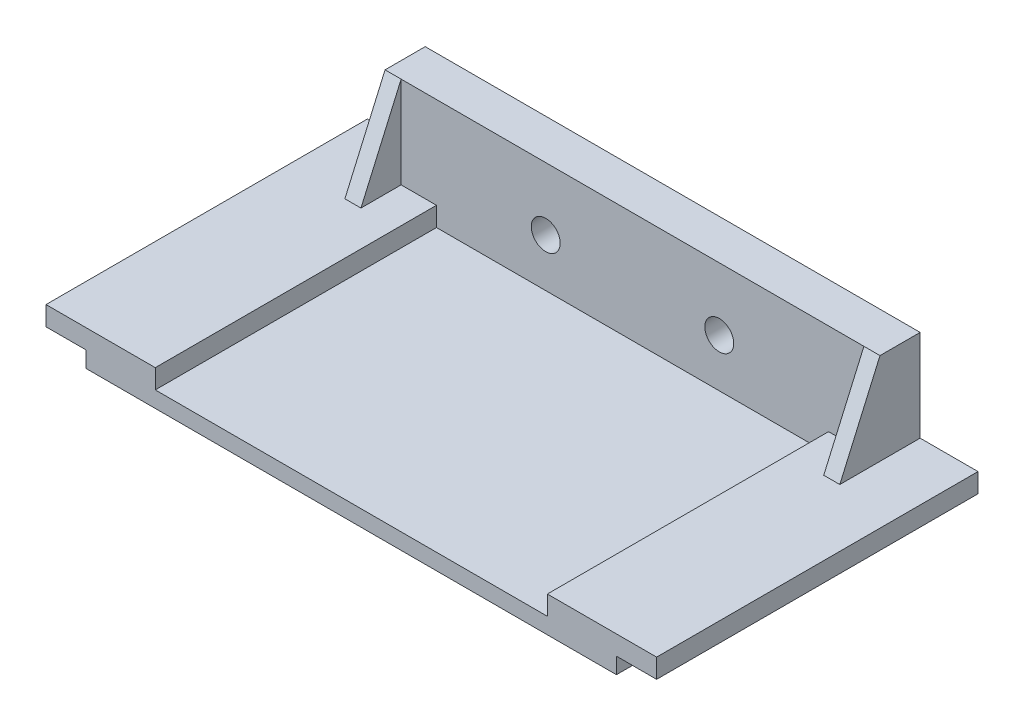
ISO-10303-21;
HEADER;
FILE_DESCRIPTION(('STEP AP214'),'2;1');
FILE_NAME('part.step','',(''),(''),'','','');
FILE_SCHEMA(('AUTOMOTIVE_DESIGN { 1 0 10303 214 1 1 1 1 }'));
ENDSEC;
DATA;
#1=APPLICATION_CONTEXT('core data for automotive mechanical design processes');
#2=APPLICATION_PROTOCOL_DEFINITION('international standard','automotive_design',2000,#1);
#3=PRODUCT_CONTEXT('',#1,'mechanical');
#4=PRODUCT('Part','Part','',(#3));
#5=PRODUCT_RELATED_PRODUCT_CATEGORY('part','',(#4));
#6=PRODUCT_DEFINITION_FORMATION('','',#4);
#7=PRODUCT_DEFINITION_CONTEXT('part definition',#1,'design');
#8=PRODUCT_DEFINITION('design','',#6,#7);
#9=PRODUCT_DEFINITION_SHAPE('','',#8);
#10=(LENGTH_UNIT() NAMED_UNIT(*) SI_UNIT(.MILLI.,.METRE.));
#11=(NAMED_UNIT(*) PLANE_ANGLE_UNIT() SI_UNIT($,.RADIAN.));
#12=(NAMED_UNIT(*) SI_UNIT($,.STERADIAN.) SOLID_ANGLE_UNIT());
#13=UNCERTAINTY_MEASURE_WITH_UNIT(LENGTH_MEASURE(1.E-05),#10,'distance_accuracy_value','');
#14=(GEOMETRIC_REPRESENTATION_CONTEXT(3) GLOBAL_UNCERTAINTY_ASSIGNED_CONTEXT((#13)) GLOBAL_UNIT_ASSIGNED_CONTEXT((#10,
#11,#12)) REPRESENTATION_CONTEXT('',''));
#15=CARTESIAN_POINT('',(0.,0.,0.));
#16=DIRECTION('',(0.,0.,1.));
#17=DIRECTION('',(1.,0.,0.));
#18=AXIS2_PLACEMENT_3D('',#15,#16,#17);
#19=CARTESIAN_POINT('',(-41.91,2.54,-25.4));
#20=DIRECTION('',(1.,0.,0.));
#21=DIRECTION('',(0.,0.,-1.));
#22=AXIS2_PLACEMENT_3D('',#19,#20,#21);
#23=PLANE('',#22);
#24=DIRECTION('',(0.,0.,1.));
#25=VECTOR('',#24,1.);
#26=CARTESIAN_POINT('',(-41.91,2.54,-25.4));
#27=LINE('',#26,#25);
#28=CARTESIAN_POINT('',(-41.91,2.54,-25.4000000000105));
#29=VERTEX_POINT('',#28);
#30=CARTESIAN_POINT('',(-41.91,2.54,25.4));
#31=VERTEX_POINT('',#30);
#32=EDGE_CURVE('E176',#29,#31,#27,.T.);
#33=ORIENTED_EDGE('',*,*,#32,.F.);
#34=DIRECTION('',(0.,-1.,0.));
#35=VECTOR('',#34,1.);
#36=CARTESIAN_POINT('',(-41.91,2.54,-25.4));
#37=LINE('',#36,#35);
#38=CARTESIAN_POINT('',(-41.91,0.,-25.4));
#39=VERTEX_POINT('',#38);
#40=EDGE_CURVE('E185',#29,#39,#37,.T.);
#41=ORIENTED_EDGE('',*,*,#40,.T.);
#42=DIRECTION('',(0.,0.,1.));
#43=VECTOR('',#42,1.);
#44=CARTESIAN_POINT('',(-41.91,0.,-25.4));
#45=LINE('',#44,#43);
#46=CARTESIAN_POINT('',(-41.91,0.,25.4));
#47=VERTEX_POINT('',#46);
#48=EDGE_CURVE('E177',#39,#47,#45,.T.);
#49=ORIENTED_EDGE('',*,*,#48,.T.);
#50=DIRECTION('',(0.,-1.,0.));
#51=VECTOR('',#50,1.);
#52=CARTESIAN_POINT('',(-41.91,2.54,25.4));
#53=LINE('',#52,#51);
#54=EDGE_CURVE('E272',#31,#47,#53,.T.);
#55=ORIENTED_EDGE('',*,*,#54,.F.);
#56=EDGE_LOOP('',(#33,#41,#49,#55));
#57=FACE_BOUND('',#56,.T.);
#58=ADVANCED_FACE('F33',(#57),#23,.F.);
#59=CARTESIAN_POINT('',(41.91,2.54,-25.4));
#60=DIRECTION('',(-1.,0.,0.));
#61=DIRECTION('',(0.,0.,1.));
#62=AXIS2_PLACEMENT_3D('',#59,#60,#61);
#63=PLANE('',#62);
#64=DIRECTION('',(0.,-1.,0.));
#65=VECTOR('',#64,1.);
#66=CARTESIAN_POINT('',(41.91,2.54,-25.4));
#67=LINE('',#66,#65);
#68=CARTESIAN_POINT('',(41.91,2.54,-25.4000000000105));
#69=VERTEX_POINT('',#68);
#70=CARTESIAN_POINT('',(41.91,0.,-25.4));
#71=VERTEX_POINT('',#70);
#72=EDGE_CURVE('E273',#69,#71,#67,.T.);
#73=ORIENTED_EDGE('',*,*,#72,.F.);
#74=DIRECTION('',(0.,0.,-1.));
#75=VECTOR('',#74,1.);
#76=CARTESIAN_POINT('',(41.91,2.54,-25.4));
#77=LINE('',#76,#75);
#78=CARTESIAN_POINT('',(41.91,2.54,25.4));
#79=VERTEX_POINT('',#78);
#80=EDGE_CURVE('E267',#79,#69,#77,.T.);
#81=ORIENTED_EDGE('',*,*,#80,.F.);
#82=DIRECTION('',(0.,-1.,0.));
#83=VECTOR('',#82,1.);
#84=CARTESIAN_POINT('',(41.91,2.54,25.4));
#85=LINE('',#84,#83);
#86=CARTESIAN_POINT('',(41.91,0.,25.4));
#87=VERTEX_POINT('',#86);
#88=EDGE_CURVE('E269',#79,#87,#85,.T.);
#89=ORIENTED_EDGE('',*,*,#88,.T.);
#90=DIRECTION('',(0.,0.,-1.));
#91=VECTOR('',#90,1.);
#92=CARTESIAN_POINT('',(41.91,0.,-25.4));
#93=LINE('',#92,#91);
#94=EDGE_CURVE('E264',#87,#71,#93,.T.);
#95=ORIENTED_EDGE('',*,*,#94,.T.);
#96=EDGE_LOOP('',(#73,#81,#89,#95));
#97=FACE_BOUND('',#96,.T.);
#98=ADVANCED_FACE('F350',(#97),#63,.F.);
#99=CARTESIAN_POINT('',(0.,5.588,0.));
#100=DIRECTION('',(0.,-1.,0.));
#101=DIRECTION('',(0.,0.,-1.));
#102=AXIS2_PLACEMENT_3D('',#99,#100,#101);
#103=PLANE('',#102);
#104=DIRECTION('',(0.,0.,-1.));
#105=VECTOR('',#104,1.);
#106=CARTESIAN_POINT('',(48.26,5.588,25.4));
#107=LINE('',#106,#105);
#108=CARTESIAN_POINT('',(48.26,5.588,25.4));
#109=VERTEX_POINT('',#108);
#110=CARTESIAN_POINT('',(48.26,5.588,-25.4000000000105));
#111=VERTEX_POINT('',#110);
#112=EDGE_CURVE('E303',#109,#111,#107,.T.);
#113=ORIENTED_EDGE('',*,*,#112,.T.);
#114=DIRECTION('',(-1.,0.,0.));
#115=VECTOR('',#114,1.);
#116=CARTESIAN_POINT('',(-48.26,5.588,-25.4));
#117=LINE('',#116,#115);
#118=CARTESIAN_POINT('',(39.116,5.588,-25.4));
#119=VERTEX_POINT('',#118);
#120=EDGE_CURVE('E308',#111,#119,#117,.T.);
#121=ORIENTED_EDGE('',*,*,#120,.T.);
#122=DIRECTION('',(0.,0.,-1.));
#123=VECTOR('',#122,1.);
#124=CARTESIAN_POINT('',(39.116,5.588,0.));
#125=LINE('',#124,#123);
#126=CARTESIAN_POINT('',(39.116,5.588,-12.7));
#127=VERTEX_POINT('',#126);
#128=EDGE_CURVE('E42',#127,#119,#125,.T.);
#129=ORIENTED_EDGE('',*,*,#128,.F.);
#130=DIRECTION('',(1.,0.,0.));
#131=VECTOR('',#130,1.);
#132=CARTESIAN_POINT('',(36.576,5.588,-12.7));
#133=LINE('',#132,#131);
#134=CARTESIAN_POINT('',(36.576,5.588,-12.7));
#135=VERTEX_POINT('',#134);
#136=EDGE_CURVE('E211',#135,#127,#133,.T.);
#137=ORIENTED_EDGE('',*,*,#136,.F.);
#138=DIRECTION('',(0.,0.,-1.));
#139=VECTOR('',#138,1.);
#140=CARTESIAN_POINT('',(36.576,5.588,-12.7));
#141=LINE('',#140,#139);
#142=CARTESIAN_POINT('',(36.576,5.588,-19.05));
#143=VERTEX_POINT('',#142);
#144=EDGE_CURVE('E199',#135,#143,#141,.T.);
#145=ORIENTED_EDGE('',*,*,#144,.T.);
#146=DIRECTION('',(1.,0.,0.));
#147=VECTOR('',#146,1.);
#148=CARTESIAN_POINT('',(0.,5.588,-19.05));
#149=LINE('',#148,#147);
#150=CARTESIAN_POINT('',(30.988,5.588,-19.05));
#151=VERTEX_POINT('',#150);
#152=EDGE_CURVE('E255',#151,#143,#149,.T.);
#153=ORIENTED_EDGE('',*,*,#152,.F.);
#154=DIRECTION('',(0.,0.,-1.));
#155=VECTOR('',#154,1.);
#156=CARTESIAN_POINT('',(30.988,5.588,0.));
#157=LINE('',#156,#155);
#158=CARTESIAN_POINT('',(30.988,5.588,25.4));
#159=VERTEX_POINT('',#158);
#160=EDGE_CURVE('E275',#159,#151,#157,.T.);
#161=ORIENTED_EDGE('',*,*,#160,.F.);
#162=DIRECTION('',(1.,0.,0.));
#163=VECTOR('',#162,1.);
#164=CARTESIAN_POINT('',(-48.26,5.588,25.4));
#165=LINE('',#164,#163);
#166=EDGE_CURVE('E311',#159,#109,#165,.T.);
#167=ORIENTED_EDGE('',*,*,#166,.T.);
#168=EDGE_LOOP('',(#113,#121,#129,#137,#145,#153,#161,#167));
#169=FACE_BOUND('',#168,.T.);
#170=ADVANCED_FACE('F357',(#169),#103,.F.);
#171=CARTESIAN_POINT('',(-39.116,20.066,-19.05));
#172=DIRECTION('',(0.,0.,-1.));
#173=DIRECTION('',(-1.,0.,0.));
#174=AXIS2_PLACEMENT_3D('',#171,#172,#173);
#175=PLANE('',#174);
#176=CARTESIAN_POINT('',(13.716,10.16,-19.05));
#177=DIRECTION('',(0.,0.,-1.));
#178=DIRECTION('',(-1.,0.,0.));
#179=AXIS2_PLACEMENT_3D('',#176,#177,#178);
#180=CIRCLE('',#179,2.286);
#181=CARTESIAN_POINT('',(11.43,10.16,-19.05));
#182=VERTEX_POINT('',#181);
#183=EDGE_CURVE('E233',#182,#182,#180,.T.);
#184=ORIENTED_EDGE('',*,*,#183,.T.);
#185=EDGE_LOOP('',(#184));
#186=FACE_BOUND('',#185,.T.);
#187=CARTESIAN_POINT('',(-13.716,10.16,-19.05));
#188=DIRECTION('',(0.,0.,-1.));
#189=DIRECTION('',(-1.,0.,0.));
#190=AXIS2_PLACEMENT_3D('',#187,#188,#189);
#191=CIRCLE('',#190,2.286);
#192=CARTESIAN_POINT('',(-16.002,10.16,-19.05));
#193=VERTEX_POINT('',#192);
#194=EDGE_CURVE('E37',#193,#193,#191,.T.);
#195=ORIENTED_EDGE('',*,*,#194,.T.);
#196=EDGE_LOOP('',(#195));
#197=FACE_BOUND('',#196,.T.);
#198=DIRECTION('',(0.,1.,0.));
#199=VECTOR('',#198,1.);
#200=CARTESIAN_POINT('',(36.576,5.588,-19.05));
#201=LINE('',#200,#199);
#202=CARTESIAN_POINT('',(36.576,20.066,-19.05));
#203=VERTEX_POINT('',#202);
#204=EDGE_CURVE('E202',#143,#203,#201,.T.);
#205=ORIENTED_EDGE('',*,*,#204,.T.);
#206=DIRECTION('',(1.,0.,0.));
#207=VECTOR('',#206,1.);
#208=CARTESIAN_POINT('',(-39.116,20.066,-19.05));
#209=LINE('',#208,#207);
#210=CARTESIAN_POINT('',(-36.576,20.066,-19.05));
#211=VERTEX_POINT('',#210);
#212=EDGE_CURVE('E244',#211,#203,#209,.T.);
#213=ORIENTED_EDGE('',*,*,#212,.F.);
#214=DIRECTION('',(0.,-1.,0.));
#215=VECTOR('',#214,1.);
#216=CARTESIAN_POINT('',(-36.576,5.588,-19.05));
#217=LINE('',#216,#215);
#218=CARTESIAN_POINT('',(-36.576,5.588,-19.05));
#219=VERTEX_POINT('',#218);
#220=EDGE_CURVE('E217',#211,#219,#217,.T.);
#221=ORIENTED_EDGE('',*,*,#220,.T.);
#222=DIRECTION('',(1.,0.,0.));
#223=VECTOR('',#222,1.);
#224=CARTESIAN_POINT('',(0.,5.588,-19.05));
#225=LINE('',#224,#223);
#226=CARTESIAN_POINT('',(-30.988,5.588,-19.05));
#227=VERTEX_POINT('',#226);
#228=EDGE_CURVE('E259',#219,#227,#225,.T.);
#229=ORIENTED_EDGE('',*,*,#228,.T.);
#230=DIRECTION('',(0.,1.,0.));
#231=VECTOR('',#230,1.);
#232=CARTESIAN_POINT('',(-30.988,2.54,-19.05));
#233=LINE('',#232,#231);
#234=CARTESIAN_POINT('',(-30.988,2.54,-19.05));
#235=VERTEX_POINT('',#234);
#236=EDGE_CURVE('E58',#235,#227,#233,.T.);
#237=ORIENTED_EDGE('',*,*,#236,.F.);
#238=DIRECTION('',(-1.,0.,0.));
#239=VECTOR('',#238,1.);
#240=CARTESIAN_POINT('',(0.,2.54,-19.05));
#241=LINE('',#240,#239);
#242=CARTESIAN_POINT('',(30.988,2.54,-19.05));
#243=VERTEX_POINT('',#242);
#244=EDGE_CURVE('E323',#243,#235,#241,.T.);
#245=ORIENTED_EDGE('',*,*,#244,.F.);
#246=DIRECTION('',(0.,1.,0.));
#247=VECTOR('',#246,1.);
#248=CARTESIAN_POINT('',(30.988,2.54,-19.05));
#249=LINE('',#248,#247);
#250=EDGE_CURVE('E253',#243,#151,#249,.T.);
#251=ORIENTED_EDGE('',*,*,#250,.T.);
#252=ORIENTED_EDGE('',*,*,#152,.T.);
#253=EDGE_LOOP('',(#205,#213,#221,#229,#237,#245,#251,#252));
#254=FACE_BOUND('',#253,.T.);
#255=ADVANCED_FACE('F332',(#186,#197,#254),#175,.F.);
#256=CARTESIAN_POINT('',(-39.116,5.588,-25.4));
#257=VERTEX_POINT('',#256);
#258=CARTESIAN_POINT('',(-48.26,5.588,-25.4000000000105));
#259=VERTEX_POINT('',#258);
#260=EDGE_CURVE('E306',#257,#259,#117,.T.);
#261=ORIENTED_EDGE('',*,*,#260,.T.);
#262=DIRECTION('',(0.,0.,1.));
#263=VECTOR('',#262,1.);
#264=CARTESIAN_POINT('',(-48.26,5.588,25.4));
#265=LINE('',#264,#263);
#266=CARTESIAN_POINT('',(-48.26,5.588,25.4));
#267=VERTEX_POINT('',#266);
#268=EDGE_CURVE('E190',#259,#267,#265,.T.);
#269=ORIENTED_EDGE('',*,*,#268,.T.);
#270=CARTESIAN_POINT('',(-30.988,5.588,25.4));
#271=VERTEX_POINT('',#270);
#272=EDGE_CURVE('E312',#267,#271,#165,.T.);
#273=ORIENTED_EDGE('',*,*,#272,.T.);
#274=DIRECTION('',(0.,0.,-1.));
#275=VECTOR('',#274,1.);
#276=CARTESIAN_POINT('',(-30.988,5.588,0.));
#277=LINE('',#276,#275);
#278=EDGE_CURVE('E287',#271,#227,#277,.T.);
#279=ORIENTED_EDGE('',*,*,#278,.T.);
#280=ORIENTED_EDGE('',*,*,#228,.F.);
#281=DIRECTION('',(0.,0.,1.));
#282=VECTOR('',#281,1.);
#283=CARTESIAN_POINT('',(-36.576,5.588,-19.05));
#284=LINE('',#283,#282);
#285=CARTESIAN_POINT('',(-36.576,5.588,-12.7));
#286=VERTEX_POINT('',#285);
#287=EDGE_CURVE('E220',#219,#286,#284,.T.);
#288=ORIENTED_EDGE('',*,*,#287,.T.);
#289=DIRECTION('',(-1.,0.,0.));
#290=VECTOR('',#289,1.);
#291=CARTESIAN_POINT('',(-36.576,5.588,-12.7));
#292=LINE('',#291,#290);
#293=CARTESIAN_POINT('',(-39.116,5.588,-12.7));
#294=VERTEX_POINT('',#293);
#295=EDGE_CURVE('E224',#286,#294,#292,.T.);
#296=ORIENTED_EDGE('',*,*,#295,.T.);
#297=DIRECTION('',(0.,0.,1.));
#298=VECTOR('',#297,1.);
#299=CARTESIAN_POINT('',(-39.116,5.588,0.));
#300=LINE('',#299,#298);
#301=EDGE_CURVE('E11',#257,#294,#300,.T.);
#302=ORIENTED_EDGE('',*,*,#301,.F.);
#303=EDGE_LOOP('',(#261,#269,#273,#279,#280,#288,#296,#302));
#304=FACE_BOUND('',#303,.T.);
#305=ADVANCED_FACE('F370',(#304),#103,.F.);
#306=CARTESIAN_POINT('',(-30.988,2.54,0.));
#307=DIRECTION('',(1.,0.,0.));
#308=DIRECTION('',(0.,0.,-1.));
#309=AXIS2_PLACEMENT_3D('',#306,#307,#308);
#310=PLANE('',#309);
#311=DIRECTION('',(0.,0.,-1.));
#312=VECTOR('',#311,1.);
#313=CARTESIAN_POINT('',(-30.988,2.54,0.));
#314=LINE('',#313,#312);
#315=CARTESIAN_POINT('',(-30.988,2.54,25.4));
#316=VERTEX_POINT('',#315);
#317=EDGE_CURVE('E290',#316,#235,#314,.T.);
#318=ORIENTED_EDGE('',*,*,#317,.T.);
#319=ORIENTED_EDGE('',*,*,#236,.T.);
#320=ORIENTED_EDGE('',*,*,#278,.F.);
#321=DIRECTION('',(0.,1.,0.));
#322=VECTOR('',#321,1.);
#323=CARTESIAN_POINT('',(-30.988,2.54,25.4));
#324=LINE('',#323,#322);
#325=EDGE_CURVE('E298',#316,#271,#324,.T.);
#326=ORIENTED_EDGE('',*,*,#325,.F.);
#327=EDGE_LOOP('',(#318,#319,#320,#326));
#328=FACE_BOUND('',#327,.T.);
#329=ADVANCED_FACE('F367',(#328),#310,.T.);
#330=CARTESIAN_POINT('',(30.988,2.54,0.));
#331=DIRECTION('',(1.,0.,0.));
#332=DIRECTION('',(0.,0.,-1.));
#333=AXIS2_PLACEMENT_3D('',#330,#331,#332);
#334=PLANE('',#333);
#335=ORIENTED_EDGE('',*,*,#250,.F.);
#336=DIRECTION('',(0.,0.,-1.));
#337=VECTOR('',#336,1.);
#338=CARTESIAN_POINT('',(30.988,2.54,0.));
#339=LINE('',#338,#337);
#340=CARTESIAN_POINT('',(30.988,2.54,25.4));
#341=VERTEX_POINT('',#340);
#342=EDGE_CURVE('E286',#341,#243,#339,.T.);
#343=ORIENTED_EDGE('',*,*,#342,.F.);
#344=DIRECTION('',(0.,1.,0.));
#345=VECTOR('',#344,1.);
#346=CARTESIAN_POINT('',(30.988,2.54,25.4));
#347=LINE('',#346,#345);
#348=EDGE_CURVE('E293',#341,#159,#347,.T.);
#349=ORIENTED_EDGE('',*,*,#348,.T.);
#350=ORIENTED_EDGE('',*,*,#160,.T.);
#351=EDGE_LOOP('',(#335,#343,#349,#350));
#352=FACE_BOUND('',#351,.T.);
#353=ADVANCED_FACE('F365',(#352),#334,.F.);
#354=CARTESIAN_POINT('',(0.,2.54,0.));
#355=DIRECTION('',(0.,1.,0.));
#356=DIRECTION('',(0.,0.,1.));
#357=AXIS2_PLACEMENT_3D('',#354,#355,#356);
#358=PLANE('',#357);
#359=ORIENTED_EDGE('',*,*,#342,.T.);
#360=ORIENTED_EDGE('',*,*,#244,.T.);
#361=ORIENTED_EDGE('',*,*,#317,.F.);
#362=DIRECTION('',(1.,0.,0.));
#363=VECTOR('',#362,1.);
#364=CARTESIAN_POINT('',(0.,2.54,25.4));
#365=LINE('',#364,#363);
#366=EDGE_CURVE('E283',#316,#341,#365,.T.);
#367=ORIENTED_EDGE('',*,*,#366,.T.);
#368=EDGE_LOOP('',(#359,#360,#361,#367));
#369=FACE_BOUND('',#368,.T.);
#370=ADVANCED_FACE('F362',(#369),#358,.T.);
#371=CARTESIAN_POINT('',(48.26,5.588,25.4));
#372=DIRECTION('',(-1.,0.,0.));
#373=DIRECTION('',(0.,0.,1.));
#374=AXIS2_PLACEMENT_3D('',#371,#372,#373);
#375=PLANE('',#374);
#376=DIRECTION('',(0.,0.,1.));
#377=VECTOR('',#376,1.);
#378=CARTESIAN_POINT('',(48.26,2.54,-25.4));
#379=LINE('',#378,#377);
#380=CARTESIAN_POINT('',(48.26,2.54,-25.4000000000105));
#381=VERTEX_POINT('',#380);
#382=CARTESIAN_POINT('',(48.26,2.54,25.4));
#383=VERTEX_POINT('',#382);
#384=EDGE_CURVE('E261',#381,#383,#379,.T.);
#385=ORIENTED_EDGE('',*,*,#384,.F.);
#386=DIRECTION('',(0.,1.,0.));
#387=VECTOR('',#386,1.);
#388=CARTESIAN_POINT('',(48.26,5.588,-25.4000000000105));
#389=LINE('',#388,#387);
#390=EDGE_CURVE('E195',#381,#111,#389,.T.);
#391=ORIENTED_EDGE('',*,*,#390,.T.);
#392=ORIENTED_EDGE('',*,*,#112,.F.);
#393=DIRECTION('',(0.,-1.,0.));
#394=VECTOR('',#393,1.);
#395=CARTESIAN_POINT('',(48.26,5.588,25.4));
#396=LINE('',#395,#394);
#397=EDGE_CURVE('E315',#109,#383,#396,.T.);
#398=ORIENTED_EDGE('',*,*,#397,.T.);
#399=EDGE_LOOP('',(#385,#391,#392,#398));
#400=FACE_BOUND('',#399,.T.);
#401=ADVANCED_FACE('F35',(#400),#375,.F.);
#402=CARTESIAN_POINT('',(-48.26,5.588,-25.4));
#403=DIRECTION('',(0.,0.,1.));
#404=DIRECTION('',(1.,0.,0.));
#405=AXIS2_PLACEMENT_3D('',#402,#403,#404);
#406=PLANE('',#405);
#407=CARTESIAN_POINT('',(-13.716,10.16,-25.4));
#408=DIRECTION('',(0.,0.,-1.));
#409=DIRECTION('',(-1.,0.,0.));
#410=AXIS2_PLACEMENT_3D('',#407,#408,#409);
#411=CIRCLE('',#410,2.286);
#412=CARTESIAN_POINT('',(-16.002,10.16,-25.4));
#413=VERTEX_POINT('',#412);
#414=EDGE_CURVE('E230',#413,#413,#411,.T.);
#415=ORIENTED_EDGE('',*,*,#414,.F.);
#416=EDGE_LOOP('',(#415));
#417=FACE_BOUND('',#416,.T.);
#418=CARTESIAN_POINT('',(13.716,10.16,-25.4));
#419=DIRECTION('',(0.,0.,-1.));
#420=DIRECTION('',(-1.,0.,0.));
#421=AXIS2_PLACEMENT_3D('',#418,#419,#420);
#422=CIRCLE('',#421,2.286);
#423=CARTESIAN_POINT('',(11.43,10.16,-25.4));
#424=VERTEX_POINT('',#423);
#425=EDGE_CURVE('E229',#424,#424,#422,.T.);
#426=ORIENTED_EDGE('',*,*,#425,.F.);
#427=EDGE_LOOP('',(#426));
#428=FACE_BOUND('',#427,.T.);
#429=ORIENTED_EDGE('',*,*,#120,.F.);
#430=ORIENTED_EDGE('',*,*,#390,.F.);
#431=DIRECTION('',(1.,0.,0.));
#432=VECTOR('',#431,1.);
#433=CARTESIAN_POINT('',(48.26,2.54,-25.4000000000105));
#434=LINE('',#433,#432);
#435=EDGE_CURVE('E186',#69,#381,#434,.T.);
#436=ORIENTED_EDGE('',*,*,#435,.F.);
#437=ORIENTED_EDGE('',*,*,#72,.T.);
#438=DIRECTION('',(-1.,0.,0.));
#439=VECTOR('',#438,1.);
#440=CARTESIAN_POINT('',(-48.26,0.,-25.4));
#441=LINE('',#440,#439);
#442=EDGE_CURVE('E301',#71,#39,#441,.T.);
#443=ORIENTED_EDGE('',*,*,#442,.T.);
#444=ORIENTED_EDGE('',*,*,#40,.F.);
#445=DIRECTION('',(1.,0.,0.));
#446=VECTOR('',#445,1.);
#447=CARTESIAN_POINT('',(-41.91,2.54,-25.4000000000105));
#448=LINE('',#447,#446);
#449=CARTESIAN_POINT('',(-48.26,2.54,-25.4000000000105));
#450=VERTEX_POINT('',#449);
#451=EDGE_CURVE('E168',#450,#29,#448,.T.);
#452=ORIENTED_EDGE('',*,*,#451,.F.);
#453=DIRECTION('',(0.,-1.,0.));
#454=VECTOR('',#453,1.);
#455=CARTESIAN_POINT('',(-48.26,2.54,-25.4000000000105));
#456=LINE('',#455,#454);
#457=EDGE_CURVE('E183',#259,#450,#456,.T.);
#458=ORIENTED_EDGE('',*,*,#457,.F.);
#459=ORIENTED_EDGE('',*,*,#260,.F.);
#460=DIRECTION('',(0.,-1.,0.));
#461=VECTOR('',#460,1.);
#462=CARTESIAN_POINT('',(-39.116,20.066,-25.4));
#463=LINE('',#462,#461);
#464=CARTESIAN_POINT('',(-39.116,20.066,-25.4));
#465=VERTEX_POINT('',#464);
#466=EDGE_CURVE('E248',#465,#257,#463,.T.);
#467=ORIENTED_EDGE('',*,*,#466,.F.);
#468=DIRECTION('',(-1.,0.,0.));
#469=VECTOR('',#468,1.);
#470=CARTESIAN_POINT('',(-39.116,20.066,-25.4));
#471=LINE('',#470,#469);
#472=CARTESIAN_POINT('',(39.116,20.066,-25.4));
#473=VERTEX_POINT('',#472);
#474=EDGE_CURVE('E239',#473,#465,#471,.T.);
#475=ORIENTED_EDGE('',*,*,#474,.F.);
#476=DIRECTION('',(0.,-1.,0.));
#477=VECTOR('',#476,1.);
#478=CARTESIAN_POINT('',(39.116,20.066,-25.4));
#479=LINE('',#478,#477);
#480=EDGE_CURVE('E250',#473,#119,#479,.T.);
#481=ORIENTED_EDGE('',*,*,#480,.T.);
#482=EDGE_LOOP('',(#429,#430,#436,#437,#443,#444,#452,#458,#459,#467,#475,#481));
#483=FACE_BOUND('',#482,.T.);
#484=ADVANCED_FACE('F181',(#417,#428,#483),#406,.F.);
#485=CARTESIAN_POINT('',(-48.26,5.588,25.4));
#486=DIRECTION('',(0.,0.,-1.));
#487=DIRECTION('',(-1.,0.,0.));
#488=AXIS2_PLACEMENT_3D('',#485,#486,#487);
#489=PLANE('',#488);
#490=DIRECTION('',(1.,0.,0.));
#491=VECTOR('',#490,1.);
#492=CARTESIAN_POINT('',(-48.26,0.,25.4));
#493=LINE('',#492,#491);
#494=EDGE_CURVE('E307',#47,#87,#493,.T.);
#495=ORIENTED_EDGE('',*,*,#494,.T.);
#496=ORIENTED_EDGE('',*,*,#88,.F.);
#497=DIRECTION('',(-1.,0.,0.));
#498=VECTOR('',#497,1.);
#499=CARTESIAN_POINT('',(48.26,2.54,25.4));
#500=LINE('',#499,#498);
#501=EDGE_CURVE('E263',#383,#79,#500,.T.);
#502=ORIENTED_EDGE('',*,*,#501,.F.);
#503=ORIENTED_EDGE('',*,*,#397,.F.);
#504=ORIENTED_EDGE('',*,*,#166,.F.);
#505=ORIENTED_EDGE('',*,*,#348,.F.);
#506=ORIENTED_EDGE('',*,*,#366,.F.);
#507=ORIENTED_EDGE('',*,*,#325,.T.);
#508=ORIENTED_EDGE('',*,*,#272,.F.);
#509=DIRECTION('',(0.,-1.,0.));
#510=VECTOR('',#509,1.);
#511=CARTESIAN_POINT('',(-48.26,5.588,25.4));
#512=LINE('',#511,#510);
#513=CARTESIAN_POINT('',(-48.26,2.54,25.4));
#514=VERTEX_POINT('',#513);
#515=EDGE_CURVE('E321',#267,#514,#512,.T.);
#516=ORIENTED_EDGE('',*,*,#515,.T.);
#517=DIRECTION('',(-1.,0.,0.));
#518=VECTOR('',#517,1.);
#519=CARTESIAN_POINT('',(-48.26,2.54,25.4));
#520=LINE('',#519,#518);
#521=EDGE_CURVE('E171',#31,#514,#520,.T.);
#522=ORIENTED_EDGE('',*,*,#521,.F.);
#523=ORIENTED_EDGE('',*,*,#54,.T.);
#524=EDGE_LOOP('',(#495,#496,#502,#503,#504,#505,#506,#507,#508,#516,#522,#523));
#525=FACE_BOUND('',#524,.T.);
#526=ADVANCED_FACE('F382',(#525),#489,.F.);
#527=CARTESIAN_POINT('',(-48.26,5.588,25.4));
#528=DIRECTION('',(1.,0.,0.));
#529=DIRECTION('',(0.,0.,-1.));
#530=AXIS2_PLACEMENT_3D('',#527,#528,#529);
#531=PLANE('',#530);
#532=ORIENTED_EDGE('',*,*,#268,.F.);
#533=ORIENTED_EDGE('',*,*,#457,.T.);
#534=DIRECTION('',(0.,0.,-1.));
#535=VECTOR('',#534,1.);
#536=CARTESIAN_POINT('',(-48.26,2.54,-25.4));
#537=LINE('',#536,#535);
#538=EDGE_CURVE('E165',#514,#450,#537,.T.);
#539=ORIENTED_EDGE('',*,*,#538,.F.);
#540=ORIENTED_EDGE('',*,*,#515,.F.);
#541=EDGE_LOOP('',(#532,#533,#539,#540));
#542=FACE_BOUND('',#541,.T.);
#543=ADVANCED_FACE('F189',(#542),#531,.F.);
#544=CARTESIAN_POINT('',(0.,0.,0.));
#545=DIRECTION('',(0.,-1.,0.));
#546=DIRECTION('',(0.,0.,-1.));
#547=AXIS2_PLACEMENT_3D('',#544,#545,#546);
#548=PLANE('',#547);
#549=ORIENTED_EDGE('',*,*,#94,.F.);
#550=ORIENTED_EDGE('',*,*,#494,.F.);
#551=ORIENTED_EDGE('',*,*,#48,.F.);
#552=ORIENTED_EDGE('',*,*,#442,.F.);
#553=EDGE_LOOP('',(#549,#550,#551,#552));
#554=FACE_BOUND('',#553,.T.);
#555=ADVANCED_FACE('F378',(#554),#548,.T.);
#556=CARTESIAN_POINT('',(0.,2.54,0.));
#557=DIRECTION('',(0.,1.,0.));
#558=DIRECTION('',(0.,0.,1.));
#559=AXIS2_PLACEMENT_3D('',#556,#557,#558);
#560=PLANE('',#559);
#561=ORIENTED_EDGE('',*,*,#538,.T.);
#562=ORIENTED_EDGE('',*,*,#451,.T.);
#563=ORIENTED_EDGE('',*,*,#32,.T.);
#564=ORIENTED_EDGE('',*,*,#521,.T.);
#565=EDGE_LOOP('',(#561,#562,#563,#564));
#566=FACE_BOUND('',#565,.T.);
#567=ADVANCED_FACE('F167',(#566),#560,.F.);
#568=CARTESIAN_POINT('',(0.,2.54,0.));
#569=DIRECTION('',(0.,-1.,0.));
#570=DIRECTION('',(0.,0.,-1.));
#571=AXIS2_PLACEMENT_3D('',#568,#569,#570);
#572=PLANE('',#571);
#573=ORIENTED_EDGE('',*,*,#80,.T.);
#574=ORIENTED_EDGE('',*,*,#435,.T.);
#575=ORIENTED_EDGE('',*,*,#384,.T.);
#576=ORIENTED_EDGE('',*,*,#501,.T.);
#577=EDGE_LOOP('',(#573,#574,#575,#576));
#578=FACE_BOUND('',#577,.T.);
#579=ADVANCED_FACE('F406',(#578),#572,.T.);
#580=CARTESIAN_POINT('',(-39.116,20.066,-19.05));
#581=DIRECTION('',(1.,0.,0.));
#582=DIRECTION('',(0.,0.,-1.));
#583=AXIS2_PLACEMENT_3D('',#580,#581,#582);
#584=PLANE('',#583);
#585=ORIENTED_EDGE('',*,*,#466,.T.);
#586=ORIENTED_EDGE('',*,*,#301,.T.);
#587=DIRECTION('',(0.,0.915788208793949,-0.401661495085065));
#588=VECTOR('',#587,1.);
#589=CARTESIAN_POINT('',(-39.116,5.588,-12.7));
#590=LINE('',#589,#588);
#591=CARTESIAN_POINT('',(-39.116,20.066,-19.05));
#592=VERTEX_POINT('',#591);
#593=EDGE_CURVE('E214',#294,#592,#590,.T.);
#594=ORIENTED_EDGE('',*,*,#593,.T.);
#595=DIRECTION('',(0.,0.,1.));
#596=VECTOR('',#595,1.);
#597=CARTESIAN_POINT('',(-39.116,20.066,-19.05));
#598=LINE('',#597,#596);
#599=EDGE_CURVE('E241',#465,#592,#598,.T.);
#600=ORIENTED_EDGE('',*,*,#599,.F.);
#601=EDGE_LOOP('',(#585,#586,#594,#600));
#602=FACE_BOUND('',#601,.T.);
#603=ADVANCED_FACE('F420',(#602),#584,.F.);
#604=CARTESIAN_POINT('',(39.116,20.066,-19.05));
#605=DIRECTION('',(-1.,0.,0.));
#606=DIRECTION('',(0.,0.,1.));
#607=AXIS2_PLACEMENT_3D('',#604,#605,#606);
#608=PLANE('',#607);
#609=DIRECTION('',(0.,0.,-1.));
#610=VECTOR('',#609,1.);
#611=CARTESIAN_POINT('',(39.116,20.066,-19.05));
#612=LINE('',#611,#610);
#613=CARTESIAN_POINT('',(39.116,20.066,-19.05));
#614=VERTEX_POINT('',#613);
#615=EDGE_CURVE('E236',#614,#473,#612,.T.);
#616=ORIENTED_EDGE('',*,*,#615,.F.);
#617=DIRECTION('',(0.,-0.915788208793949,0.401661495085065));
#618=VECTOR('',#617,1.);
#619=CARTESIAN_POINT('',(39.116,20.066,-19.05));
#620=LINE('',#619,#618);
#621=EDGE_CURVE('E198',#614,#127,#620,.T.);
#622=ORIENTED_EDGE('',*,*,#621,.T.);
#623=ORIENTED_EDGE('',*,*,#128,.T.);
#624=ORIENTED_EDGE('',*,*,#480,.F.);
#625=EDGE_LOOP('',(#616,#622,#623,#624));
#626=FACE_BOUND('',#625,.T.);
#627=ADVANCED_FACE('F427',(#626),#608,.F.);
#628=CARTESIAN_POINT('',(0.,20.066,0.));
#629=DIRECTION('',(0.,-1.,0.));
#630=DIRECTION('',(0.,0.,-1.));
#631=AXIS2_PLACEMENT_3D('',#628,#629,#630);
#632=PLANE('',#631);
#633=ORIENTED_EDGE('',*,*,#615,.T.);
#634=ORIENTED_EDGE('',*,*,#474,.T.);
#635=ORIENTED_EDGE('',*,*,#599,.T.);
#636=EDGE_CURVE('E245',#592,#211,#209,.T.);
#637=ORIENTED_EDGE('',*,*,#636,.T.);
#638=ORIENTED_EDGE('',*,*,#212,.T.);
#639=DIRECTION('',(1.,0.,0.));
#640=VECTOR('',#639,1.);
#641=CARTESIAN_POINT('',(36.576,20.066,-19.05));
#642=LINE('',#641,#640);
#643=EDGE_CURVE('E208',#203,#614,#642,.T.);
#644=ORIENTED_EDGE('',*,*,#643,.T.);
#645=EDGE_LOOP('',(#633,#634,#635,#637,#638,#644));
#646=FACE_BOUND('',#645,.T.);
#647=ADVANCED_FACE('F346',(#646),#632,.F.);
#648=CARTESIAN_POINT('',(13.716,10.16,25.4));
#649=DIRECTION('',(0.,0.,-1.));
#650=DIRECTION('',(-1.,0.,0.));
#651=AXIS2_PLACEMENT_3D('',#648,#649,#650);
#652=CYLINDRICAL_SURFACE('',#651,2.286);
#653=ORIENTED_EDGE('',*,*,#425,.T.);
#654=EDGE_LOOP('',(#653));
#655=FACE_BOUND('',#654,.T.);
#656=ORIENTED_EDGE('',*,*,#183,.F.);
#657=EDGE_LOOP('',(#656));
#658=FACE_BOUND('',#657,.T.);
#659=ADVANCED_FACE('F337',(#655,#658),#652,.F.);
#660=CARTESIAN_POINT('',(-13.716,10.16,25.4));
#661=DIRECTION('',(0.,0.,-1.));
#662=DIRECTION('',(-1.,0.,0.));
#663=AXIS2_PLACEMENT_3D('',#660,#661,#662);
#664=CYLINDRICAL_SURFACE('',#663,2.286);
#665=ORIENTED_EDGE('',*,*,#414,.T.);
#666=EDGE_LOOP('',(#665));
#667=FACE_BOUND('',#666,.T.);
#668=ORIENTED_EDGE('',*,*,#194,.F.);
#669=EDGE_LOOP('',(#668));
#670=FACE_BOUND('',#669,.T.);
#671=ADVANCED_FACE('F334',(#667,#670),#664,.F.);
#672=CARTESIAN_POINT('',(-36.576,5.588,-12.7));
#673=DIRECTION('',(0.,0.401661495085065,0.915788208793949));
#674=DIRECTION('',(0.,-0.915788208793949,0.401661495085065));
#675=AXIS2_PLACEMENT_3D('',#672,#673,#674);
#676=PLANE('',#675);
#677=ORIENTED_EDGE('',*,*,#593,.F.);
#678=ORIENTED_EDGE('',*,*,#295,.F.);
#679=DIRECTION('',(0.,0.915788208793949,-0.401661495085065));
#680=VECTOR('',#679,1.);
#681=CARTESIAN_POINT('',(-36.576,5.588,-12.7));
#682=LINE('',#681,#680);
#683=EDGE_CURVE('E50',#286,#211,#682,.T.);
#684=ORIENTED_EDGE('',*,*,#683,.T.);
#685=ORIENTED_EDGE('',*,*,#636,.F.);
#686=EDGE_LOOP('',(#677,#678,#684,#685));
#687=FACE_BOUND('',#686,.T.);
#688=ADVANCED_FACE('F336',(#687),#676,.T.);
#689=CARTESIAN_POINT('',(-36.576,0.,0.));
#690=DIRECTION('',(1.,0.,0.));
#691=DIRECTION('',(0.,0.,-1.));
#692=AXIS2_PLACEMENT_3D('',#689,#690,#691);
#693=PLANE('',#692);
#694=ORIENTED_EDGE('',*,*,#220,.F.);
#695=ORIENTED_EDGE('',*,*,#683,.F.);
#696=ORIENTED_EDGE('',*,*,#287,.F.);
#697=EDGE_LOOP('',(#694,#695,#696));
#698=FACE_BOUND('',#697,.T.);
#699=ADVANCED_FACE('F344',(#698),#693,.T.);
#700=CARTESIAN_POINT('',(36.576,20.066,-19.05));
#701=DIRECTION('',(0.,0.401661495085065,0.915788208793949));
#702=DIRECTION('',(0.,-0.915788208793949,0.401661495085065));
#703=AXIS2_PLACEMENT_3D('',#700,#701,#702);
#704=PLANE('',#703);
#705=ORIENTED_EDGE('',*,*,#621,.F.);
#706=ORIENTED_EDGE('',*,*,#643,.F.);
#707=DIRECTION('',(0.,-0.915788208793949,0.401661495085065));
#708=VECTOR('',#707,1.);
#709=CARTESIAN_POINT('',(36.576,20.066,-19.05));
#710=LINE('',#709,#708);
#711=EDGE_CURVE('E205',#203,#135,#710,.T.);
#712=ORIENTED_EDGE('',*,*,#711,.T.);
#713=ORIENTED_EDGE('',*,*,#136,.T.);
#714=EDGE_LOOP('',(#705,#706,#712,#713));
#715=FACE_BOUND('',#714,.T.);
#716=ADVANCED_FACE('F431',(#715),#704,.T.);
#717=CARTESIAN_POINT('',(36.576,0.,0.));
#718=DIRECTION('',(1.,0.,0.));
#719=DIRECTION('',(0.,0.,-1.));
#720=AXIS2_PLACEMENT_3D('',#717,#718,#719);
#721=PLANE('',#720);
#722=ORIENTED_EDGE('',*,*,#144,.F.);
#723=ORIENTED_EDGE('',*,*,#711,.F.);
#724=ORIENTED_EDGE('',*,*,#204,.F.);
#725=EDGE_LOOP('',(#722,#723,#724));
#726=FACE_BOUND('',#725,.T.);
#727=ADVANCED_FACE('F434',(#726),#721,.F.);
#728=CLOSED_SHELL('',(#58,#98,#170,#255,#305,#329,#353,#370,#401,#484,#526,#543,#555,#567,#579,
#603,#627,#647,#659,#671,#688,#699,#716,#727));
#729=MANIFOLD_SOLID_BREP('B2',#728);
#730=ADVANCED_BREP_SHAPE_REPRESENTATION('',(#18,#729),#14);
#731=SHAPE_DEFINITION_REPRESENTATION(#9,#730);
ENDSEC;
END-ISO-10303-21;
